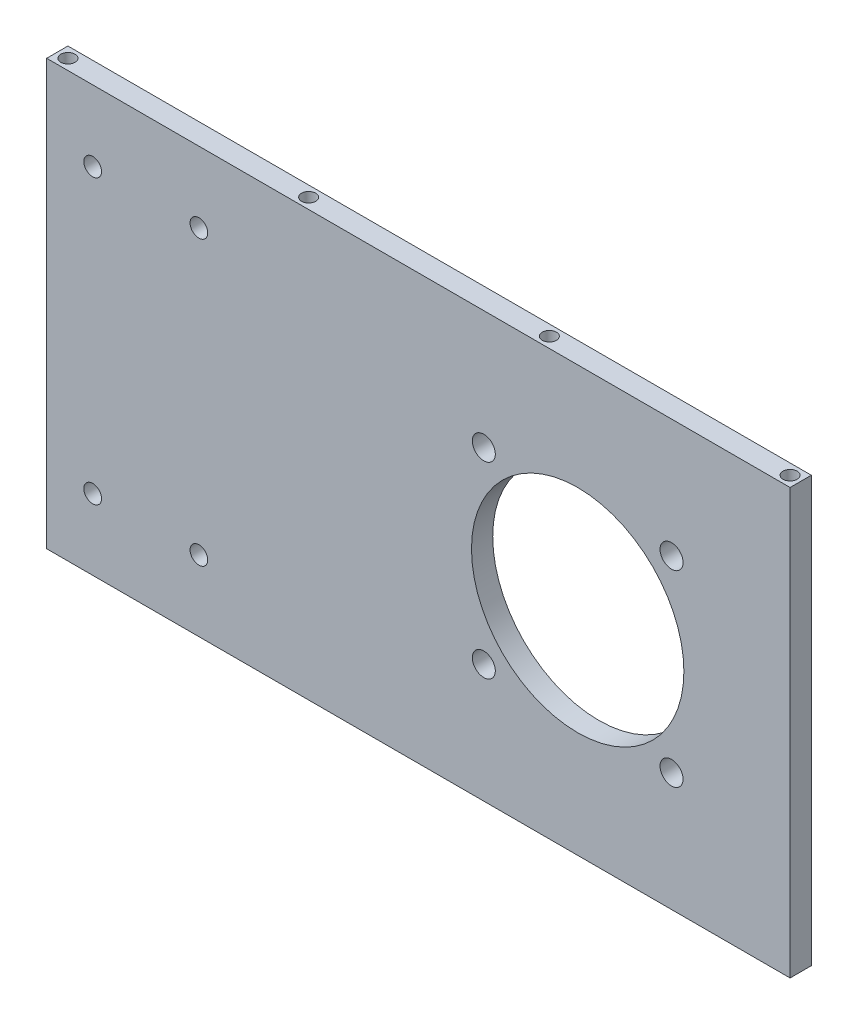
ISO-10303-21;
HEADER;
FILE_DESCRIPTION(('STEP AP214'),'2;1');
FILE_NAME('part.step','',(''),(''),'','','');
FILE_SCHEMA(('AUTOMOTIVE_DESIGN { 1 0 10303 214 1 1 1 1 }'));
ENDSEC;
DATA;
#1=APPLICATION_CONTEXT('core data for automotive mechanical design processes');
#2=APPLICATION_PROTOCOL_DEFINITION('international standard','automotive_design',2000,#1);
#3=PRODUCT_CONTEXT('',#1,'mechanical');
#4=PRODUCT('Part','Part','',(#3));
#5=PRODUCT_RELATED_PRODUCT_CATEGORY('part','',(#4));
#6=PRODUCT_DEFINITION_FORMATION('','',#4);
#7=PRODUCT_DEFINITION_CONTEXT('part definition',#1,'design');
#8=PRODUCT_DEFINITION('design','',#6,#7);
#9=PRODUCT_DEFINITION_SHAPE('','',#8);
#10=(LENGTH_UNIT() NAMED_UNIT(*) SI_UNIT(.MILLI.,.METRE.));
#11=(NAMED_UNIT(*) PLANE_ANGLE_UNIT() SI_UNIT($,.RADIAN.));
#12=(NAMED_UNIT(*) SI_UNIT($,.STERADIAN.) SOLID_ANGLE_UNIT());
#13=UNCERTAINTY_MEASURE_WITH_UNIT(LENGTH_MEASURE(1.E-05),#10,'distance_accuracy_value','');
#14=(GEOMETRIC_REPRESENTATION_CONTEXT(3) GLOBAL_UNCERTAINTY_ASSIGNED_CONTEXT((#13)) GLOBAL_UNIT_ASSIGNED_CONTEXT((#10,
#11,#12)) REPRESENTATION_CONTEXT('',''));
#15=CARTESIAN_POINT('',(0.,0.,0.));
#16=DIRECTION('',(0.,0.,1.));
#17=DIRECTION('',(1.,0.,0.));
#18=AXIS2_PLACEMENT_3D('',#15,#16,#17);
#19=CARTESIAN_POINT('',(60.,60.,6.));
#20=DIRECTION('',(0.,-1.,0.));
#21=DIRECTION('',(1.,0.,0.));
#22=AXIS2_PLACEMENT_3D('',#19,#20,#21);
#23=PLANE('',#22);
#24=CARTESIAN_POINT('',(-79.,60.,3.));
#25=DIRECTION('',(0.,-1.,0.));
#26=DIRECTION('',(1.,0.,0.));
#27=AXIS2_PLACEMENT_3D('',#24,#25,#26);
#28=CIRCLE('',#27,2.);
#29=CARTESIAN_POINT('',(-77.,60.,3.));
#30=VERTEX_POINT('',#29);
#31=EDGE_CURVE('E252',#30,#30,#28,.T.);
#32=ORIENTED_EDGE('',*,*,#31,.T.);
#33=EDGE_LOOP('',(#32));
#34=FACE_BOUND('',#33,.T.);
#35=CARTESIAN_POINT('',(57.,60.,3.));
#36=DIRECTION('',(0.,-1.,0.));
#37=DIRECTION('',(1.,0.,0.));
#38=AXIS2_PLACEMENT_3D('',#35,#36,#37);
#39=CIRCLE('',#38,2.);
#40=CARTESIAN_POINT('',(59.,60.,3.));
#41=VERTEX_POINT('',#40);
#42=EDGE_CURVE('E240',#41,#41,#39,.T.);
#43=ORIENTED_EDGE('',*,*,#42,.T.);
#44=EDGE_LOOP('',(#43));
#45=FACE_BOUND('',#44,.T.);
#46=DIRECTION('',(-1.,0.,0.));
#47=VECTOR('',#46,1.);
#48=CARTESIAN_POINT('',(60.,60.,0.));
#49=LINE('',#48,#47);
#50=CARTESIAN_POINT('',(60.,60.,0.));
#51=VERTEX_POINT('',#50);
#52=CARTESIAN_POINT('',(-150.,60.,0.));
#53=VERTEX_POINT('',#52);
#54=EDGE_CURVE('E71',#51,#53,#49,.T.);
#55=ORIENTED_EDGE('',*,*,#54,.T.);
#56=DIRECTION('',(0.,0.,-1.));
#57=VECTOR('',#56,1.);
#58=CARTESIAN_POINT('',(-150.,60.,6.));
#59=LINE('',#58,#57);
#60=CARTESIAN_POINT('',(-150.,60.,6.));
#61=VERTEX_POINT('',#60);
#62=EDGE_CURVE('E95',#61,#53,#59,.T.);
#63=ORIENTED_EDGE('',*,*,#62,.F.);
#64=DIRECTION('',(-1.,0.,0.));
#65=VECTOR('',#64,1.);
#66=CARTESIAN_POINT('',(60.,60.,6.));
#67=LINE('',#66,#65);
#68=CARTESIAN_POINT('',(60.,60.,6.));
#69=VERTEX_POINT('',#68);
#70=EDGE_CURVE('E88',#69,#61,#67,.T.);
#71=ORIENTED_EDGE('',*,*,#70,.F.);
#72=DIRECTION('',(0.,0.,-1.));
#73=VECTOR('',#72,1.);
#74=CARTESIAN_POINT('',(60.,60.,6.));
#75=LINE('',#74,#73);
#76=EDGE_CURVE('E45',#69,#51,#75,.T.);
#77=ORIENTED_EDGE('',*,*,#76,.T.);
#78=EDGE_LOOP('',(#55,#63,#71,#77));
#79=FACE_BOUND('',#78,.T.);
#80=CARTESIAN_POINT('',(-11.,60.,3.));
#81=DIRECTION('',(0.,-1.,0.));
#82=DIRECTION('',(1.,0.,0.));
#83=AXIS2_PLACEMENT_3D('',#80,#81,#82);
#84=CIRCLE('',#83,2.);
#85=CARTESIAN_POINT('',(-9.,60.,3.));
#86=VERTEX_POINT('',#85);
#87=EDGE_CURVE('E246',#86,#86,#84,.T.);
#88=ORIENTED_EDGE('',*,*,#87,.T.);
#89=EDGE_LOOP('',(#88));
#90=FACE_BOUND('',#89,.T.);
#91=CARTESIAN_POINT('',(-147.,60.,3.));
#92=DIRECTION('',(0.,-1.,0.));
#93=DIRECTION('',(1.,0.,0.));
#94=AXIS2_PLACEMENT_3D('',#91,#92,#93);
#95=CIRCLE('',#94,2.);
#96=CARTESIAN_POINT('',(-145.,60.,3.));
#97=VERTEX_POINT('',#96);
#98=EDGE_CURVE('E257',#97,#97,#95,.T.);
#99=ORIENTED_EDGE('',*,*,#98,.T.);
#100=EDGE_LOOP('',(#99));
#101=FACE_BOUND('',#100,.T.);
#102=ADVANCED_FACE('F35',(#34,#45,#79,#90,#101),#23,.F.);
#103=CARTESIAN_POINT('',(0.,0.,6.));
#104=DIRECTION('',(0.,0.,1.));
#105=DIRECTION('',(1.,0.,0.));
#106=AXIS2_PLACEMENT_3D('',#103,#104,#105);
#107=PLANE('',#106);
#108=CARTESIAN_POINT('',(-137.,-40.,6.));
#109=DIRECTION('',(0.,0.,1.));
#110=DIRECTION('',(1.,0.,0.));
#111=AXIS2_PLACEMENT_3D('',#108,#109,#110);
#112=CIRCLE('',#111,2.5);
#113=CARTESIAN_POINT('',(-134.5,-40.,6.));
#114=VERTEX_POINT('',#113);
#115=EDGE_CURVE('E132',#114,#114,#112,.T.);
#116=ORIENTED_EDGE('',*,*,#115,.F.);
#117=EDGE_LOOP('',(#116));
#118=FACE_BOUND('',#117,.T.);
#119=CARTESIAN_POINT('',(-107.,-40.,6.));
#120=DIRECTION('',(0.,0.,1.));
#121=DIRECTION('',(1.,0.,0.));
#122=AXIS2_PLACEMENT_3D('',#119,#120,#121);
#123=CIRCLE('',#122,2.50000000000001);
#124=CARTESIAN_POINT('',(-104.5,-40.,6.));
#125=VERTEX_POINT('',#124);
#126=EDGE_CURVE('E122',#125,#125,#123,.T.);
#127=ORIENTED_EDGE('',*,*,#126,.F.);
#128=EDGE_LOOP('',(#127));
#129=FACE_BOUND('',#128,.T.);
#130=CARTESIAN_POINT('',(-107.,40.,6.));
#131=DIRECTION('',(0.,0.,1.));
#132=DIRECTION('',(1.,0.,0.));
#133=AXIS2_PLACEMENT_3D('',#130,#131,#132);
#134=CIRCLE('',#133,2.5);
#135=CARTESIAN_POINT('',(-104.5,40.,6.));
#136=VERTEX_POINT('',#135);
#137=EDGE_CURVE('E119',#136,#136,#134,.T.);
#138=ORIENTED_EDGE('',*,*,#137,.F.);
#139=EDGE_LOOP('',(#138));
#140=FACE_BOUND('',#139,.T.);
#141=CARTESIAN_POINT('',(-137.,40.,6.));
#142=DIRECTION('',(0.,0.,1.));
#143=DIRECTION('',(1.,0.,0.));
#144=AXIS2_PLACEMENT_3D('',#141,#142,#143);
#145=CIRCLE('',#144,2.5);
#146=CARTESIAN_POINT('',(-134.5,40.,6.));
#147=VERTEX_POINT('',#146);
#148=EDGE_CURVE('E116',#147,#147,#145,.T.);
#149=ORIENTED_EDGE('',*,*,#148,.F.);
#150=EDGE_LOOP('',(#149));
#151=FACE_BOUND('',#150,.T.);
#152=CARTESIAN_POINT('',(-26.5165042944938,-26.5165042944972,6.));
#153=DIRECTION('',(0.,0.,1.));
#154=DIRECTION('',(1.,0.,0.));
#155=AXIS2_PLACEMENT_3D('',#152,#153,#154);
#156=CIRCLE('',#155,3.25);
#157=CARTESIAN_POINT('',(-23.2665042944938,-26.5165042944972,6.));
#158=VERTEX_POINT('',#157);
#159=EDGE_CURVE('E144',#158,#158,#156,.T.);
#160=ORIENTED_EDGE('',*,*,#159,.F.);
#161=EDGE_LOOP('',(#160));
#162=FACE_BOUND('',#161,.T.);
#163=CARTESIAN_POINT('',(0.,0.,6.));
#164=DIRECTION('',(0.,0.,1.));
#165=DIRECTION('',(1.,0.,0.));
#166=AXIS2_PLACEMENT_3D('',#163,#164,#165);
#167=CIRCLE('',#166,30.);
#168=CARTESIAN_POINT('',(30.,0.,6.));
#169=VERTEX_POINT('',#168);
#170=EDGE_CURVE('E156',#169,#169,#167,.T.);
#171=ORIENTED_EDGE('',*,*,#170,.F.);
#172=EDGE_LOOP('',(#171));
#173=FACE_BOUND('',#172,.T.);
#174=DIRECTION('',(1.,0.,0.));
#175=VECTOR('',#174,1.);
#176=CARTESIAN_POINT('',(60.,-60.,6.));
#177=LINE('',#176,#175);
#178=CARTESIAN_POINT('',(-150.,-60.,6.));
#179=VERTEX_POINT('',#178);
#180=CARTESIAN_POINT('',(60.,-60.,6.));
#181=VERTEX_POINT('',#180);
#182=EDGE_CURVE('E90',#179,#181,#177,.T.);
#183=ORIENTED_EDGE('',*,*,#182,.T.);
#184=DIRECTION('',(0.,1.,0.));
#185=VECTOR('',#184,1.);
#186=CARTESIAN_POINT('',(60.,-60.,6.));
#187=LINE('',#186,#185);
#188=EDGE_CURVE('E84',#181,#69,#187,.T.);
#189=ORIENTED_EDGE('',*,*,#188,.T.);
#190=ORIENTED_EDGE('',*,*,#70,.T.);
#191=DIRECTION('',(0.,-1.,0.));
#192=VECTOR('',#191,1.);
#193=CARTESIAN_POINT('',(-150.,60.,6.));
#194=LINE('',#193,#192);
#195=EDGE_CURVE('E54',#61,#179,#194,.T.);
#196=ORIENTED_EDGE('',*,*,#195,.T.);
#197=EDGE_LOOP('',(#183,#189,#190,#196));
#198=FACE_BOUND('',#197,.T.);
#199=CARTESIAN_POINT('',(26.5165042944955,26.5165042944956,6.));
#200=DIRECTION('',(0.,0.,1.));
#201=DIRECTION('',(1.,0.,0.));
#202=AXIS2_PLACEMENT_3D('',#199,#200,#201);
#203=CIRCLE('',#202,3.25);
#204=CARTESIAN_POINT('',(29.7665042944955,26.5165042944956,6.));
#205=VERTEX_POINT('',#204);
#206=EDGE_CURVE('E106',#205,#205,#203,.T.);
#207=ORIENTED_EDGE('',*,*,#206,.F.);
#208=EDGE_LOOP('',(#207));
#209=FACE_BOUND('',#208,.T.);
#210=CARTESIAN_POINT('',(26.5165042944972,-26.5165042944955,6.));
#211=DIRECTION('',(0.,0.,1.));
#212=DIRECTION('',(1.,0.,0.));
#213=AXIS2_PLACEMENT_3D('',#210,#211,#212);
#214=CIRCLE('',#213,3.25);
#215=CARTESIAN_POINT('',(29.7665042944972,-26.5165042944955,6.));
#216=VERTEX_POINT('',#215);
#217=EDGE_CURVE('E150',#216,#216,#214,.T.);
#218=ORIENTED_EDGE('',*,*,#217,.F.);
#219=EDGE_LOOP('',(#218));
#220=FACE_BOUND('',#219,.T.);
#221=CARTESIAN_POINT('',(-26.5165042944956,26.5165042944938,6.));
#222=DIRECTION('',(0.,0.,1.));
#223=DIRECTION('',(1.,0.,0.));
#224=AXIS2_PLACEMENT_3D('',#221,#222,#223);
#225=CIRCLE('',#224,3.25);
#226=CARTESIAN_POINT('',(-23.2665042944956,26.5165042944938,6.));
#227=VERTEX_POINT('',#226);
#228=EDGE_CURVE('E138',#227,#227,#225,.T.);
#229=ORIENTED_EDGE('',*,*,#228,.F.);
#230=EDGE_LOOP('',(#229));
#231=FACE_BOUND('',#230,.T.);
#232=ADVANCED_FACE('F85',(#118,#129,#140,#151,#162,#173,#198,#209,#220,#231),#107,.T.);
#233=CARTESIAN_POINT('',(0.,0.,0.));
#234=DIRECTION('',(0.,0.,1.));
#235=DIRECTION('',(1.,0.,0.));
#236=AXIS2_PLACEMENT_3D('',#233,#234,#235);
#237=PLANE('',#236);
#238=CARTESIAN_POINT('',(-137.,-40.,0.));
#239=DIRECTION('',(0.,0.,1.));
#240=DIRECTION('',(1.,0.,0.));
#241=AXIS2_PLACEMENT_3D('',#238,#239,#240);
#242=CIRCLE('',#241,2.5);
#243=CARTESIAN_POINT('',(-134.5,-40.,0.));
#244=VERTEX_POINT('',#243);
#245=EDGE_CURVE('E39',#244,#244,#242,.T.);
#246=ORIENTED_EDGE('',*,*,#245,.T.);
#247=EDGE_LOOP('',(#246));
#248=FACE_BOUND('',#247,.T.);
#249=CARTESIAN_POINT('',(-107.,-40.,0.));
#250=DIRECTION('',(0.,0.,1.));
#251=DIRECTION('',(1.,0.,0.));
#252=AXIS2_PLACEMENT_3D('',#249,#250,#251);
#253=CIRCLE('',#252,2.50000000000001);
#254=CARTESIAN_POINT('',(-104.5,-40.,0.));
#255=VERTEX_POINT('',#254);
#256=EDGE_CURVE('E120',#255,#255,#253,.T.);
#257=ORIENTED_EDGE('',*,*,#256,.T.);
#258=EDGE_LOOP('',(#257));
#259=FACE_BOUND('',#258,.T.);
#260=CARTESIAN_POINT('',(-107.,40.,0.));
#261=DIRECTION('',(0.,0.,1.));
#262=DIRECTION('',(1.,0.,0.));
#263=AXIS2_PLACEMENT_3D('',#260,#261,#262);
#264=CIRCLE('',#263,2.5);
#265=CARTESIAN_POINT('',(-104.5,40.,0.));
#266=VERTEX_POINT('',#265);
#267=EDGE_CURVE('E117',#266,#266,#264,.T.);
#268=ORIENTED_EDGE('',*,*,#267,.T.);
#269=EDGE_LOOP('',(#268));
#270=FACE_BOUND('',#269,.T.);
#271=CARTESIAN_POINT('',(-137.,40.,0.));
#272=DIRECTION('',(0.,0.,1.));
#273=DIRECTION('',(1.,0.,0.));
#274=AXIS2_PLACEMENT_3D('',#271,#272,#273);
#275=CIRCLE('',#274,2.5);
#276=CARTESIAN_POINT('',(-134.5,40.,0.));
#277=VERTEX_POINT('',#276);
#278=EDGE_CURVE('E112',#277,#277,#275,.T.);
#279=ORIENTED_EDGE('',*,*,#278,.T.);
#280=EDGE_LOOP('',(#279));
#281=FACE_BOUND('',#280,.T.);
#282=CARTESIAN_POINT('',(-26.5165042944938,-26.5165042944972,0.));
#283=DIRECTION('',(0.,0.,1.));
#284=DIRECTION('',(1.,0.,0.));
#285=AXIS2_PLACEMENT_3D('',#282,#283,#284);
#286=CIRCLE('',#285,3.25);
#287=CARTESIAN_POINT('',(-23.2665042944938,-26.5165042944972,0.));
#288=VERTEX_POINT('',#287);
#289=EDGE_CURVE('E141',#288,#288,#286,.T.);
#290=ORIENTED_EDGE('',*,*,#289,.T.);
#291=EDGE_LOOP('',(#290));
#292=FACE_BOUND('',#291,.T.);
#293=CARTESIAN_POINT('',(0.,0.,0.));
#294=DIRECTION('',(0.,0.,1.));
#295=DIRECTION('',(1.,0.,0.));
#296=AXIS2_PLACEMENT_3D('',#293,#294,#295);
#297=CIRCLE('',#296,30.);
#298=CARTESIAN_POINT('',(30.,0.,0.));
#299=VERTEX_POINT('',#298);
#300=EDGE_CURVE('E153',#299,#299,#297,.T.);
#301=ORIENTED_EDGE('',*,*,#300,.T.);
#302=EDGE_LOOP('',(#301));
#303=FACE_BOUND('',#302,.T.);
#304=DIRECTION('',(1.,0.,0.));
#305=VECTOR('',#304,1.);
#306=CARTESIAN_POINT('',(60.,-60.,0.));
#307=LINE('',#306,#305);
#308=CARTESIAN_POINT('',(-150.,-60.,0.));
#309=VERTEX_POINT('',#308);
#310=CARTESIAN_POINT('',(60.,-60.,0.));
#311=VERTEX_POINT('',#310);
#312=EDGE_CURVE('E103',#309,#311,#307,.T.);
#313=ORIENTED_EDGE('',*,*,#312,.F.);
#314=DIRECTION('',(0.,-1.,0.));
#315=VECTOR('',#314,1.);
#316=CARTESIAN_POINT('',(-150.,60.,0.));
#317=LINE('',#316,#315);
#318=EDGE_CURVE('E77',#53,#309,#317,.T.);
#319=ORIENTED_EDGE('',*,*,#318,.F.);
#320=ORIENTED_EDGE('',*,*,#54,.F.);
#321=DIRECTION('',(0.,1.,0.));
#322=VECTOR('',#321,1.);
#323=CARTESIAN_POINT('',(60.,-60.,0.));
#324=LINE('',#323,#322);
#325=EDGE_CURVE('E94',#311,#51,#324,.T.);
#326=ORIENTED_EDGE('',*,*,#325,.F.);
#327=EDGE_LOOP('',(#313,#319,#320,#326));
#328=FACE_BOUND('',#327,.T.);
#329=CARTESIAN_POINT('',(26.5165042944955,26.5165042944956,0.));
#330=DIRECTION('',(0.,0.,1.));
#331=DIRECTION('',(1.,0.,0.));
#332=AXIS2_PLACEMENT_3D('',#329,#330,#331);
#333=CIRCLE('',#332,3.25);
#334=CARTESIAN_POINT('',(29.7665042944955,26.5165042944956,0.));
#335=VERTEX_POINT('',#334);
#336=EDGE_CURVE('E159',#335,#335,#333,.T.);
#337=ORIENTED_EDGE('',*,*,#336,.T.);
#338=EDGE_LOOP('',(#337));
#339=FACE_BOUND('',#338,.T.);
#340=CARTESIAN_POINT('',(26.5165042944972,-26.5165042944955,0.));
#341=DIRECTION('',(0.,0.,1.));
#342=DIRECTION('',(1.,0.,0.));
#343=AXIS2_PLACEMENT_3D('',#340,#341,#342);
#344=CIRCLE('',#343,3.25);
#345=CARTESIAN_POINT('',(29.7665042944972,-26.5165042944955,0.));
#346=VERTEX_POINT('',#345);
#347=EDGE_CURVE('E147',#346,#346,#344,.T.);
#348=ORIENTED_EDGE('',*,*,#347,.T.);
#349=EDGE_LOOP('',(#348));
#350=FACE_BOUND('',#349,.T.);
#351=CARTESIAN_POINT('',(-26.5165042944956,26.5165042944938,0.));
#352=DIRECTION('',(0.,0.,1.));
#353=DIRECTION('',(1.,0.,0.));
#354=AXIS2_PLACEMENT_3D('',#351,#352,#353);
#355=CIRCLE('',#354,3.25);
#356=CARTESIAN_POINT('',(-23.2665042944956,26.5165042944938,0.));
#357=VERTEX_POINT('',#356);
#358=EDGE_CURVE('E115',#357,#357,#355,.T.);
#359=ORIENTED_EDGE('',*,*,#358,.T.);
#360=EDGE_LOOP('',(#359));
#361=FACE_BOUND('',#360,.T.);
#362=ADVANCED_FACE('F167',(#248,#259,#270,#281,#292,#303,#328,#339,#350,#361),#237,.F.);
#363=CARTESIAN_POINT('',(60.,-60.,6.));
#364=DIRECTION('',(0.,1.,0.));
#365=DIRECTION('',(-1.,0.,0.));
#366=AXIS2_PLACEMENT_3D('',#363,#364,#365);
#367=PLANE('',#366);
#368=CARTESIAN_POINT('',(-147.,-60.,3.));
#369=DIRECTION('',(0.,-1.,0.));
#370=DIRECTION('',(1.,0.,0.));
#371=AXIS2_PLACEMENT_3D('',#368,#369,#370);
#372=CIRCLE('',#371,2.);
#373=CARTESIAN_POINT('',(-145.,-60.,3.));
#374=VERTEX_POINT('',#373);
#375=EDGE_CURVE('E207',#374,#374,#372,.T.);
#376=ORIENTED_EDGE('',*,*,#375,.F.);
#377=EDGE_LOOP('',(#376));
#378=FACE_BOUND('',#377,.T.);
#379=CARTESIAN_POINT('',(-79.,-60.,3.));
#380=DIRECTION('',(0.,-1.,0.));
#381=DIRECTION('',(1.,0.,0.));
#382=AXIS2_PLACEMENT_3D('',#379,#380,#381);
#383=CIRCLE('',#382,2.);
#384=CARTESIAN_POINT('',(-77.,-60.,3.));
#385=VERTEX_POINT('',#384);
#386=EDGE_CURVE('E211',#385,#385,#383,.T.);
#387=ORIENTED_EDGE('',*,*,#386,.F.);
#388=EDGE_LOOP('',(#387));
#389=FACE_BOUND('',#388,.T.);
#390=CARTESIAN_POINT('',(-11.,-60.,3.));
#391=DIRECTION('',(0.,-1.,0.));
#392=DIRECTION('',(1.,0.,0.));
#393=AXIS2_PLACEMENT_3D('',#390,#391,#392);
#394=CIRCLE('',#393,2.);
#395=CARTESIAN_POINT('',(-9.,-60.,3.));
#396=VERTEX_POINT('',#395);
#397=EDGE_CURVE('E215',#396,#396,#394,.T.);
#398=ORIENTED_EDGE('',*,*,#397,.F.);
#399=EDGE_LOOP('',(#398));
#400=FACE_BOUND('',#399,.T.);
#401=CARTESIAN_POINT('',(57.,-60.,3.));
#402=DIRECTION('',(0.,-1.,0.));
#403=DIRECTION('',(1.,0.,0.));
#404=AXIS2_PLACEMENT_3D('',#401,#402,#403);
#405=CIRCLE('',#404,2.);
#406=CARTESIAN_POINT('',(59.,-60.,3.));
#407=VERTEX_POINT('',#406);
#408=EDGE_CURVE('E219',#407,#407,#405,.T.);
#409=ORIENTED_EDGE('',*,*,#408,.F.);
#410=EDGE_LOOP('',(#409));
#411=FACE_BOUND('',#410,.T.);
#412=ORIENTED_EDGE('',*,*,#312,.T.);
#413=DIRECTION('',(0.,0.,-1.));
#414=VECTOR('',#413,1.);
#415=CARTESIAN_POINT('',(60.,-60.,6.));
#416=LINE('',#415,#414);
#417=EDGE_CURVE('E11',#181,#311,#416,.T.);
#418=ORIENTED_EDGE('',*,*,#417,.F.);
#419=ORIENTED_EDGE('',*,*,#182,.F.);
#420=DIRECTION('',(0.,0.,-1.));
#421=VECTOR('',#420,1.);
#422=CARTESIAN_POINT('',(-150.,-60.,6.));
#423=LINE('',#422,#421);
#424=EDGE_CURVE('E99',#179,#309,#423,.T.);
#425=ORIENTED_EDGE('',*,*,#424,.T.);
#426=EDGE_LOOP('',(#412,#418,#419,#425));
#427=FACE_BOUND('',#426,.T.);
#428=ADVANCED_FACE('F37',(#378,#389,#400,#411,#427),#367,.F.);
#429=CARTESIAN_POINT('',(60.,-60.,6.));
#430=DIRECTION('',(-1.,0.,0.));
#431=DIRECTION('',(0.,0.,1.));
#432=AXIS2_PLACEMENT_3D('',#429,#430,#431);
#433=PLANE('',#432);
#434=ORIENTED_EDGE('',*,*,#325,.T.);
#435=ORIENTED_EDGE('',*,*,#76,.F.);
#436=ORIENTED_EDGE('',*,*,#188,.F.);
#437=ORIENTED_EDGE('',*,*,#417,.T.);
#438=EDGE_LOOP('',(#434,#435,#436,#437));
#439=FACE_BOUND('',#438,.T.);
#440=ADVANCED_FACE('F93',(#439),#433,.F.);
#441=CARTESIAN_POINT('',(-150.,60.,6.));
#442=DIRECTION('',(1.,0.,0.));
#443=DIRECTION('',(0.,0.,-1.));
#444=AXIS2_PLACEMENT_3D('',#441,#442,#443);
#445=PLANE('',#444);
#446=ORIENTED_EDGE('',*,*,#318,.T.);
#447=ORIENTED_EDGE('',*,*,#424,.F.);
#448=ORIENTED_EDGE('',*,*,#195,.F.);
#449=ORIENTED_EDGE('',*,*,#62,.T.);
#450=EDGE_LOOP('',(#446,#447,#448,#449));
#451=FACE_BOUND('',#450,.T.);
#452=ADVANCED_FACE('F173',(#451),#445,.F.);
#453=CARTESIAN_POINT('',(26.5165042944955,26.5165042944956,6.));
#454=DIRECTION('',(0.,0.,-1.));
#455=DIRECTION('',(-1.,0.,0.));
#456=AXIS2_PLACEMENT_3D('',#453,#454,#455);
#457=CYLINDRICAL_SURFACE('',#456,3.25);
#458=ORIENTED_EDGE('',*,*,#206,.T.);
#459=EDGE_LOOP('',(#458));
#460=FACE_BOUND('',#459,.T.);
#461=ORIENTED_EDGE('',*,*,#336,.F.);
#462=EDGE_LOOP('',(#461));
#463=FACE_BOUND('',#462,.T.);
#464=ADVANCED_FACE('F170',(#460,#463),#457,.F.);
#465=CARTESIAN_POINT('',(0.,0.,6.));
#466=DIRECTION('',(0.,0.,-1.));
#467=DIRECTION('',(-1.,0.,0.));
#468=AXIS2_PLACEMENT_3D('',#465,#466,#467);
#469=CYLINDRICAL_SURFACE('',#468,30.);
#470=ORIENTED_EDGE('',*,*,#170,.T.);
#471=EDGE_LOOP('',(#470));
#472=FACE_BOUND('',#471,.T.);
#473=ORIENTED_EDGE('',*,*,#300,.F.);
#474=EDGE_LOOP('',(#473));
#475=FACE_BOUND('',#474,.T.);
#476=ADVANCED_FACE('F172',(#472,#475),#469,.F.);
#477=CARTESIAN_POINT('',(26.5165042944972,-26.5165042944955,6.));
#478=DIRECTION('',(0.,0.,-1.));
#479=DIRECTION('',(-1.,0.,0.));
#480=AXIS2_PLACEMENT_3D('',#477,#478,#479);
#481=CYLINDRICAL_SURFACE('',#480,3.25);
#482=ORIENTED_EDGE('',*,*,#217,.T.);
#483=EDGE_LOOP('',(#482));
#484=FACE_BOUND('',#483,.T.);
#485=ORIENTED_EDGE('',*,*,#347,.F.);
#486=EDGE_LOOP('',(#485));
#487=FACE_BOUND('',#486,.T.);
#488=ADVANCED_FACE('F180',(#484,#487),#481,.F.);
#489=CARTESIAN_POINT('',(-26.5165042944938,-26.5165042944972,6.));
#490=DIRECTION('',(0.,0.,-1.));
#491=DIRECTION('',(-1.,0.,0.));
#492=AXIS2_PLACEMENT_3D('',#489,#490,#491);
#493=CYLINDRICAL_SURFACE('',#492,3.25);
#494=ORIENTED_EDGE('',*,*,#159,.T.);
#495=EDGE_LOOP('',(#494));
#496=FACE_BOUND('',#495,.T.);
#497=ORIENTED_EDGE('',*,*,#289,.F.);
#498=EDGE_LOOP('',(#497));
#499=FACE_BOUND('',#498,.T.);
#500=ADVANCED_FACE('F348',(#496,#499),#493,.F.);
#501=CARTESIAN_POINT('',(-26.5165042944956,26.5165042944938,6.));
#502=DIRECTION('',(0.,0.,-1.));
#503=DIRECTION('',(-1.,0.,0.));
#504=AXIS2_PLACEMENT_3D('',#501,#502,#503);
#505=CYLINDRICAL_SURFACE('',#504,3.25);
#506=ORIENTED_EDGE('',*,*,#228,.T.);
#507=EDGE_LOOP('',(#506));
#508=FACE_BOUND('',#507,.T.);
#509=ORIENTED_EDGE('',*,*,#358,.F.);
#510=EDGE_LOOP('',(#509));
#511=FACE_BOUND('',#510,.T.);
#512=ADVANCED_FACE('F344',(#508,#511),#505,.F.);
#513=CARTESIAN_POINT('',(-137.,40.,-4.));
#514=DIRECTION('',(0.,0.,1.));
#515=DIRECTION('',(1.,0.,0.));
#516=AXIS2_PLACEMENT_3D('',#513,#514,#515);
#517=CYLINDRICAL_SURFACE('',#516,2.5);
#518=ORIENTED_EDGE('',*,*,#148,.T.);
#519=EDGE_LOOP('',(#518));
#520=FACE_BOUND('',#519,.T.);
#521=ORIENTED_EDGE('',*,*,#278,.F.);
#522=EDGE_LOOP('',(#521));
#523=FACE_BOUND('',#522,.T.);
#524=ADVANCED_FACE('F340',(#520,#523),#517,.F.);
#525=CARTESIAN_POINT('',(-107.,40.,-4.));
#526=DIRECTION('',(0.,0.,1.));
#527=DIRECTION('',(1.,0.,0.));
#528=AXIS2_PLACEMENT_3D('',#525,#526,#527);
#529=CYLINDRICAL_SURFACE('',#528,2.5);
#530=ORIENTED_EDGE('',*,*,#137,.T.);
#531=EDGE_LOOP('',(#530));
#532=FACE_BOUND('',#531,.T.);
#533=ORIENTED_EDGE('',*,*,#267,.F.);
#534=EDGE_LOOP('',(#533));
#535=FACE_BOUND('',#534,.T.);
#536=ADVANCED_FACE('F337',(#532,#535),#529,.F.);
#537=CARTESIAN_POINT('',(-107.,-40.,-4.));
#538=DIRECTION('',(0.,0.,1.));
#539=DIRECTION('',(1.,0.,0.));
#540=AXIS2_PLACEMENT_3D('',#537,#538,#539);
#541=CYLINDRICAL_SURFACE('',#540,2.50000000000001);
#542=ORIENTED_EDGE('',*,*,#126,.T.);
#543=EDGE_LOOP('',(#542));
#544=FACE_BOUND('',#543,.T.);
#545=ORIENTED_EDGE('',*,*,#256,.F.);
#546=EDGE_LOOP('',(#545));
#547=FACE_BOUND('',#546,.T.);
#548=ADVANCED_FACE('F333',(#544,#547),#541,.F.);
#549=CARTESIAN_POINT('',(-137.,-40.,-4.));
#550=DIRECTION('',(0.,0.,1.));
#551=DIRECTION('',(1.,0.,0.));
#552=AXIS2_PLACEMENT_3D('',#549,#550,#551);
#553=CYLINDRICAL_SURFACE('',#552,2.5);
#554=ORIENTED_EDGE('',*,*,#115,.T.);
#555=EDGE_LOOP('',(#554));
#556=FACE_BOUND('',#555,.T.);
#557=ORIENTED_EDGE('',*,*,#245,.F.);
#558=EDGE_LOOP('',(#557));
#559=FACE_BOUND('',#558,.T.);
#560=ADVANCED_FACE('F329',(#556,#559),#553,.F.);
#561=CARTESIAN_POINT('',(57.,-40.,3.));
#562=DIRECTION('',(0.,-1.,0.));
#563=DIRECTION('',(1.,0.,0.));
#564=AXIS2_PLACEMENT_3D('',#561,#562,#563);
#565=CYLINDRICAL_SURFACE('',#564,2.);
#566=CARTESIAN_POINT('',(57.,-40.,3.));
#567=DIRECTION('',(0.,-1.,0.));
#568=DIRECTION('',(1.,0.,0.));
#569=AXIS2_PLACEMENT_3D('',#566,#567,#568);
#570=CIRCLE('',#569,2.);
#571=CARTESIAN_POINT('',(59.,-40.,3.));
#572=VERTEX_POINT('',#571);
#573=EDGE_CURVE('E223',#572,#572,#570,.T.);
#574=ORIENTED_EDGE('',*,*,#573,.F.);
#575=EDGE_LOOP('',(#574));
#576=FACE_BOUND('',#575,.T.);
#577=ORIENTED_EDGE('',*,*,#408,.T.);
#578=EDGE_LOOP('',(#577));
#579=FACE_BOUND('',#578,.T.);
#580=ADVANCED_FACE('F325',(#576,#579),#565,.F.);
#581=CARTESIAN_POINT('',(57.,-40.,3.));
#582=DIRECTION('',(0.,-1.,0.));
#583=DIRECTION('',(1.,0.,0.));
#584=AXIS2_PLACEMENT_3D('',#581,#582,#583);
#585=PLANE('',#584);
#586=ORIENTED_EDGE('',*,*,#573,.T.);
#587=EDGE_LOOP('',(#586));
#588=FACE_BOUND('',#587,.T.);
#589=ADVANCED_FACE('F321',(#588),#585,.T.);
#590=CARTESIAN_POINT('',(-11.,-40.,3.));
#591=DIRECTION('',(0.,-1.,0.));
#592=DIRECTION('',(1.,0.,0.));
#593=AXIS2_PLACEMENT_3D('',#590,#591,#592);
#594=CYLINDRICAL_SURFACE('',#593,2.);
#595=CARTESIAN_POINT('',(-11.,-40.,3.));
#596=DIRECTION('',(0.,-1.,0.));
#597=DIRECTION('',(1.,0.,0.));
#598=AXIS2_PLACEMENT_3D('',#595,#596,#597);
#599=CIRCLE('',#598,2.);
#600=CARTESIAN_POINT('',(-9.,-40.,3.));
#601=VERTEX_POINT('',#600);
#602=EDGE_CURVE('E224',#601,#601,#599,.T.);
#603=ORIENTED_EDGE('',*,*,#602,.F.);
#604=EDGE_LOOP('',(#603));
#605=FACE_BOUND('',#604,.T.);
#606=ORIENTED_EDGE('',*,*,#397,.T.);
#607=EDGE_LOOP('',(#606));
#608=FACE_BOUND('',#607,.T.);
#609=ADVANCED_FACE('F317',(#605,#608),#594,.F.);
#610=CARTESIAN_POINT('',(-11.,-40.,3.));
#611=DIRECTION('',(0.,-1.,0.));
#612=DIRECTION('',(1.,0.,0.));
#613=AXIS2_PLACEMENT_3D('',#610,#611,#612);
#614=PLANE('',#613);
#615=ORIENTED_EDGE('',*,*,#602,.T.);
#616=EDGE_LOOP('',(#615));
#617=FACE_BOUND('',#616,.T.);
#618=ADVANCED_FACE('F313',(#617),#614,.T.);
#619=CARTESIAN_POINT('',(-79.,-40.,3.));
#620=DIRECTION('',(0.,-1.,0.));
#621=DIRECTION('',(1.,0.,0.));
#622=AXIS2_PLACEMENT_3D('',#619,#620,#621);
#623=CYLINDRICAL_SURFACE('',#622,2.);
#624=CARTESIAN_POINT('',(-79.,-40.,3.));
#625=DIRECTION('',(0.,-1.,0.));
#626=DIRECTION('',(1.,0.,0.));
#627=AXIS2_PLACEMENT_3D('',#624,#625,#626);
#628=CIRCLE('',#627,2.);
#629=CARTESIAN_POINT('',(-77.,-40.,3.));
#630=VERTEX_POINT('',#629);
#631=EDGE_CURVE('E230',#630,#630,#628,.T.);
#632=ORIENTED_EDGE('',*,*,#631,.F.);
#633=EDGE_LOOP('',(#632));
#634=FACE_BOUND('',#633,.T.);
#635=ORIENTED_EDGE('',*,*,#386,.T.);
#636=EDGE_LOOP('',(#635));
#637=FACE_BOUND('',#636,.T.);
#638=ADVANCED_FACE('F309',(#634,#637),#623,.F.);
#639=CARTESIAN_POINT('',(-79.,-40.,3.));
#640=DIRECTION('',(0.,-1.,0.));
#641=DIRECTION('',(1.,0.,0.));
#642=AXIS2_PLACEMENT_3D('',#639,#640,#641);
#643=PLANE('',#642);
#644=ORIENTED_EDGE('',*,*,#631,.T.);
#645=EDGE_LOOP('',(#644));
#646=FACE_BOUND('',#645,.T.);
#647=ADVANCED_FACE('F305',(#646),#643,.T.);
#648=CARTESIAN_POINT('',(-147.,-40.,3.));
#649=DIRECTION('',(0.,-1.,0.));
#650=DIRECTION('',(1.,0.,0.));
#651=AXIS2_PLACEMENT_3D('',#648,#649,#650);
#652=CYLINDRICAL_SURFACE('',#651,2.);
#653=CARTESIAN_POINT('',(-147.,-40.,3.));
#654=DIRECTION('',(0.,-1.,0.));
#655=DIRECTION('',(1.,0.,0.));
#656=AXIS2_PLACEMENT_3D('',#653,#654,#655);
#657=CIRCLE('',#656,2.);
#658=CARTESIAN_POINT('',(-145.,-40.,3.));
#659=VERTEX_POINT('',#658);
#660=EDGE_CURVE('E233',#659,#659,#657,.T.);
#661=ORIENTED_EDGE('',*,*,#660,.F.);
#662=EDGE_LOOP('',(#661));
#663=FACE_BOUND('',#662,.T.);
#664=ORIENTED_EDGE('',*,*,#375,.T.);
#665=EDGE_LOOP('',(#664));
#666=FACE_BOUND('',#665,.T.);
#667=ADVANCED_FACE('F301',(#663,#666),#652,.F.);
#668=CARTESIAN_POINT('',(-147.,-40.,3.));
#669=DIRECTION('',(0.,-1.,0.));
#670=DIRECTION('',(1.,0.,0.));
#671=AXIS2_PLACEMENT_3D('',#668,#669,#670);
#672=PLANE('',#671);
#673=ORIENTED_EDGE('',*,*,#660,.T.);
#674=EDGE_LOOP('',(#673));
#675=FACE_BOUND('',#674,.T.);
#676=ADVANCED_FACE('F297',(#675),#672,.T.);
#677=CARTESIAN_POINT('',(57.,40.,3.));
#678=DIRECTION('',(0.,1.,0.));
#679=DIRECTION('',(-1.,0.,0.));
#680=AXIS2_PLACEMENT_3D('',#677,#678,#679);
#681=CYLINDRICAL_SURFACE('',#680,2.);
#682=CARTESIAN_POINT('',(57.,40.,3.));
#683=DIRECTION('',(0.,-1.,0.));
#684=DIRECTION('',(1.,0.,0.));
#685=AXIS2_PLACEMENT_3D('',#682,#683,#684);
#686=CIRCLE('',#685,2.);
#687=CARTESIAN_POINT('',(59.,40.,3.));
#688=VERTEX_POINT('',#687);
#689=EDGE_CURVE('E237',#688,#688,#686,.T.);
#690=ORIENTED_EDGE('',*,*,#689,.T.);
#691=EDGE_LOOP('',(#690));
#692=FACE_BOUND('',#691,.T.);
#693=ORIENTED_EDGE('',*,*,#42,.F.);
#694=EDGE_LOOP('',(#693));
#695=FACE_BOUND('',#694,.T.);
#696=ADVANCED_FACE('F293',(#692,#695),#681,.F.);
#697=CARTESIAN_POINT('',(57.,40.,3.));
#698=DIRECTION('',(0.,1.,0.));
#699=DIRECTION('',(1.,0.,0.));
#700=AXIS2_PLACEMENT_3D('',#697,#698,#699);
#701=PLANE('',#700);
#702=ORIENTED_EDGE('',*,*,#689,.F.);
#703=EDGE_LOOP('',(#702));
#704=FACE_BOUND('',#703,.T.);
#705=ADVANCED_FACE('F289',(#704),#701,.T.);
#706=CARTESIAN_POINT('',(-11.,40.,3.));
#707=DIRECTION('',(0.,1.,0.));
#708=DIRECTION('',(-1.,0.,0.));
#709=AXIS2_PLACEMENT_3D('',#706,#707,#708);
#710=CYLINDRICAL_SURFACE('',#709,2.);
#711=CARTESIAN_POINT('',(-11.,40.,3.));
#712=DIRECTION('',(0.,-1.,0.));
#713=DIRECTION('',(1.,0.,0.));
#714=AXIS2_PLACEMENT_3D('',#711,#712,#713);
#715=CIRCLE('',#714,2.);
#716=CARTESIAN_POINT('',(-9.,40.,3.));
#717=VERTEX_POINT('',#716);
#718=EDGE_CURVE('E243',#717,#717,#715,.T.);
#719=ORIENTED_EDGE('',*,*,#718,.T.);
#720=EDGE_LOOP('',(#719));
#721=FACE_BOUND('',#720,.T.);
#722=ORIENTED_EDGE('',*,*,#87,.F.);
#723=EDGE_LOOP('',(#722));
#724=FACE_BOUND('',#723,.T.);
#725=ADVANCED_FACE('F285',(#721,#724),#710,.F.);
#726=CARTESIAN_POINT('',(-11.,40.,3.));
#727=DIRECTION('',(0.,1.,0.));
#728=DIRECTION('',(1.,0.,0.));
#729=AXIS2_PLACEMENT_3D('',#726,#727,#728);
#730=PLANE('',#729);
#731=ORIENTED_EDGE('',*,*,#718,.F.);
#732=EDGE_LOOP('',(#731));
#733=FACE_BOUND('',#732,.T.);
#734=ADVANCED_FACE('F281',(#733),#730,.T.);
#735=CARTESIAN_POINT('',(-79.,40.,3.));
#736=DIRECTION('',(0.,1.,0.));
#737=DIRECTION('',(-1.,0.,0.));
#738=AXIS2_PLACEMENT_3D('',#735,#736,#737);
#739=CYLINDRICAL_SURFACE('',#738,2.);
#740=CARTESIAN_POINT('',(-79.,40.,3.));
#741=DIRECTION('',(0.,-1.,0.));
#742=DIRECTION('',(1.,0.,0.));
#743=AXIS2_PLACEMENT_3D('',#740,#741,#742);
#744=CIRCLE('',#743,2.);
#745=CARTESIAN_POINT('',(-77.,40.,3.));
#746=VERTEX_POINT('',#745);
#747=EDGE_CURVE('E249',#746,#746,#744,.T.);
#748=ORIENTED_EDGE('',*,*,#747,.T.);
#749=EDGE_LOOP('',(#748));
#750=FACE_BOUND('',#749,.T.);
#751=ORIENTED_EDGE('',*,*,#31,.F.);
#752=EDGE_LOOP('',(#751));
#753=FACE_BOUND('',#752,.T.);
#754=ADVANCED_FACE('F277',(#750,#753),#739,.F.);
#755=CARTESIAN_POINT('',(-79.,40.,3.));
#756=DIRECTION('',(0.,1.,0.));
#757=DIRECTION('',(1.,0.,0.));
#758=AXIS2_PLACEMENT_3D('',#755,#756,#757);
#759=PLANE('',#758);
#760=ORIENTED_EDGE('',*,*,#747,.F.);
#761=EDGE_LOOP('',(#760));
#762=FACE_BOUND('',#761,.T.);
#763=ADVANCED_FACE('F272',(#762),#759,.T.);
#764=CARTESIAN_POINT('',(-147.,40.,3.));
#765=DIRECTION('',(0.,1.,0.));
#766=DIRECTION('',(-1.,0.,0.));
#767=AXIS2_PLACEMENT_3D('',#764,#765,#766);
#768=CYLINDRICAL_SURFACE('',#767,2.);
#769=CARTESIAN_POINT('',(-147.,40.,3.));
#770=DIRECTION('',(0.,-1.,0.));
#771=DIRECTION('',(1.,0.,0.));
#772=AXIS2_PLACEMENT_3D('',#769,#770,#771);
#773=CIRCLE('',#772,2.);
#774=CARTESIAN_POINT('',(-145.,40.,3.));
#775=VERTEX_POINT('',#774);
#776=EDGE_CURVE('E254',#775,#775,#773,.T.);
#777=ORIENTED_EDGE('',*,*,#776,.T.);
#778=EDGE_LOOP('',(#777));
#779=FACE_BOUND('',#778,.T.);
#780=ORIENTED_EDGE('',*,*,#98,.F.);
#781=EDGE_LOOP('',(#780));
#782=FACE_BOUND('',#781,.T.);
#783=ADVANCED_FACE('F263',(#779,#782),#768,.F.);
#784=CARTESIAN_POINT('',(-147.,40.,3.));
#785=DIRECTION('',(0.,1.,0.));
#786=DIRECTION('',(1.,0.,0.));
#787=AXIS2_PLACEMENT_3D('',#784,#785,#786);
#788=PLANE('',#787);
#789=ORIENTED_EDGE('',*,*,#776,.F.);
#790=EDGE_LOOP('',(#789));
#791=FACE_BOUND('',#790,.T.);
#792=ADVANCED_FACE('F266',(#791),#788,.T.);
#793=CLOSED_SHELL('',(#102,#232,#362,#428,#440,#452,#464,#476,#488,#500,#512,#524,#536,#548,
#560,#580,#589,#609,#618,#638,#647,#667,#676,#696,#705,#725,#734,#754,#763,#783,#792));
#794=MANIFOLD_SOLID_BREP('B2',#793);
#795=ADVANCED_BREP_SHAPE_REPRESENTATION('',(#18,#794),#14);
#796=SHAPE_DEFINITION_REPRESENTATION(#9,#795);
ENDSEC;
END-ISO-10303-21;
